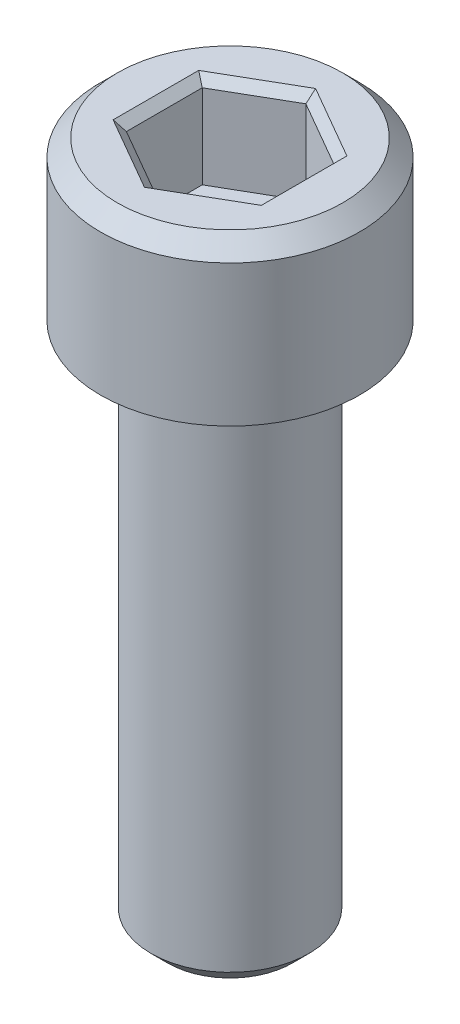
ISO-10303-21;
HEADER;
FILE_DESCRIPTION(('STEP AP214'),'2;1');
FILE_NAME('part.step','',(''),(''),'','','');
FILE_SCHEMA(('AUTOMOTIVE_DESIGN { 1 0 10303 214 1 1 1 1 }'));
ENDSEC;
DATA;
#1=APPLICATION_CONTEXT('core data for automotive mechanical design processes');
#2=APPLICATION_PROTOCOL_DEFINITION('international standard','automotive_design',2000,#1);
#3=PRODUCT_CONTEXT('',#1,'mechanical');
#4=PRODUCT('Part','Part','',(#3));
#5=PRODUCT_RELATED_PRODUCT_CATEGORY('part','',(#4));
#6=PRODUCT_DEFINITION_FORMATION('','',#4);
#7=PRODUCT_DEFINITION_CONTEXT('part definition',#1,'design');
#8=PRODUCT_DEFINITION('design','',#6,#7);
#9=PRODUCT_DEFINITION_SHAPE('','',#8);
#10=(LENGTH_UNIT() NAMED_UNIT(*) SI_UNIT(.MILLI.,.METRE.));
#11=(NAMED_UNIT(*) PLANE_ANGLE_UNIT() SI_UNIT($,.RADIAN.));
#12=(NAMED_UNIT(*) SI_UNIT($,.STERADIAN.) SOLID_ANGLE_UNIT());
#13=UNCERTAINTY_MEASURE_WITH_UNIT(LENGTH_MEASURE(1.E-05),#10,'distance_accuracy_value','');
#14=(GEOMETRIC_REPRESENTATION_CONTEXT(3) GLOBAL_UNCERTAINTY_ASSIGNED_CONTEXT((#13)) GLOBAL_UNIT_ASSIGNED_CONTEXT((#10,
#11,#12)) REPRESENTATION_CONTEXT('',''));
#15=CARTESIAN_POINT('',(0.,0.,0.));
#16=DIRECTION('',(0.,0.,1.));
#17=DIRECTION('',(1.,0.,0.));
#18=AXIS2_PLACEMENT_3D('',#15,#16,#17);
#19=CARTESIAN_POINT('',(-3.96874999999999,-2.79399999999996,0.));
#20=DIRECTION('',(0.,-1.,0.));
#21=DIRECTION('',(0.,0.,-1.));
#22=AXIS2_PLACEMENT_3D('',#19,#20,#21);
#23=PLANE('',#22);
#24=DIRECTION('',(-0.866025403784439,0.,0.5));
#25=VECTOR('',#24,1.);
#26=CARTESIAN_POINT('',(1.98437500000001,-2.79399999999996,1.14567944042317));
#27=LINE('',#26,#25);
#28=CARTESIAN_POINT('',(1.98437500000001,-2.79399999999996,1.14567944042317));
#29=VERTEX_POINT('',#28);
#30=CARTESIAN_POINT('',(0.,-2.79399999999996,2.29135888084634));
#31=VERTEX_POINT('',#30);
#32=EDGE_CURVE('E86',#29,#31,#27,.T.);
#33=ORIENTED_EDGE('',*,*,#32,.F.);
#34=DIRECTION('',(0.,0.,1.));
#35=VECTOR('',#34,1.);
#36=CARTESIAN_POINT('',(1.98437500000001,-2.79399999999996,-1.14567944042316));
#37=LINE('',#36,#35);
#38=CARTESIAN_POINT('',(1.98437500000001,-2.79399999999996,-1.14567944042316));
#39=VERTEX_POINT('',#38);
#40=EDGE_CURVE('E91',#39,#29,#37,.T.);
#41=ORIENTED_EDGE('',*,*,#40,.F.);
#42=DIRECTION('',(0.866025403784439,0.,0.5));
#43=VECTOR('',#42,1.);
#44=CARTESIAN_POINT('',(0.,-2.79399999999996,-2.29135888084632));
#45=LINE('',#44,#43);
#46=CARTESIAN_POINT('',(0.,-2.79399999999996,-2.29135888084632));
#47=VERTEX_POINT('',#46);
#48=EDGE_CURVE('E172',#47,#39,#45,.T.);
#49=ORIENTED_EDGE('',*,*,#48,.F.);
#50=DIRECTION('',(0.866025403784438,0.,-0.500000000000001));
#51=VECTOR('',#50,1.);
#52=CARTESIAN_POINT('',(-1.984375,-2.79399999999996,-1.14567944042316));
#53=LINE('',#52,#51);
#54=CARTESIAN_POINT('',(-1.984375,-2.79399999999996,-1.14567944042316));
#55=VERTEX_POINT('',#54);
#56=EDGE_CURVE('E178',#55,#47,#53,.T.);
#57=ORIENTED_EDGE('',*,*,#56,.F.);
#58=DIRECTION('',(0.,0.,-1.));
#59=VECTOR('',#58,1.);
#60=CARTESIAN_POINT('',(-1.984375,-2.79399999999996,1.14567944042317));
#61=LINE('',#60,#59);
#62=CARTESIAN_POINT('',(-1.984375,-2.79399999999996,1.14567944042317));
#63=VERTEX_POINT('',#62);
#64=EDGE_CURVE('E183',#63,#55,#61,.T.);
#65=ORIENTED_EDGE('',*,*,#64,.F.);
#66=DIRECTION('',(-0.866025403784438,0.,-0.5));
#67=VECTOR('',#66,1.);
#68=CARTESIAN_POINT('',(0.,-2.79399999999996,2.29135888084634));
#69=LINE('',#68,#67);
#70=EDGE_CURVE('E102',#31,#63,#69,.T.);
#71=ORIENTED_EDGE('',*,*,#70,.F.);
#72=EDGE_LOOP('',(#33,#41,#49,#57,#65,#71));
#73=FACE_BOUND('',#72,.T.);
#74=ADVANCED_FACE('F17',(#73),#23,.F.);
#75=CARTESIAN_POINT('',(1.98437500000001,-2.79399999999996,-1.14567944042316));
#76=DIRECTION('',(-1.,0.,0.));
#77=DIRECTION('',(0.,0.,1.));
#78=AXIS2_PLACEMENT_3D('',#75,#76,#77);
#79=PLANE('',#78);
#80=DIRECTION('',(0.,1.,0.));
#81=VECTOR('',#80,1.);
#82=CARTESIAN_POINT('',(1.98437500000001,-2.79399999999996,-1.14567944042315));
#83=LINE('',#82,#81);
#84=CARTESIAN_POINT('',(1.98437500000001,-0.25399999999998,-1.14567944042316));
#85=VERTEX_POINT('',#84);
#86=EDGE_CURVE('E96',#39,#85,#83,.T.);
#87=ORIENTED_EDGE('',*,*,#86,.F.);
#88=ORIENTED_EDGE('',*,*,#40,.T.);
#89=DIRECTION('',(0.,1.,0.));
#90=VECTOR('',#89,1.);
#91=CARTESIAN_POINT('',(1.98437500000001,-2.79399999999996,1.14567944042317));
#92=LINE('',#91,#90);
#93=CARTESIAN_POINT('',(1.98437500000001,-0.253999999999979,1.14567944042318));
#94=VERTEX_POINT('',#93);
#95=EDGE_CURVE('E93',#94,#29,#92,.F.);
#96=ORIENTED_EDGE('',*,*,#95,.F.);
#97=DIRECTION('',(0.,0.,1.));
#98=VECTOR('',#97,1.);
#99=CARTESIAN_POINT('',(1.98437500000002,-0.253999999999987,0.));
#100=LINE('',#99,#98);
#101=EDGE_CURVE('E170',#94,#85,#100,.F.);
#102=ORIENTED_EDGE('',*,*,#101,.T.);
#103=EDGE_LOOP('',(#87,#88,#96,#102));
#104=FACE_BOUND('',#103,.T.);
#105=ADVANCED_FACE('F92',(#104),#79,.T.);
#106=CARTESIAN_POINT('',(1.98437500000001,-2.79399999999996,1.14567944042317));
#107=DIRECTION('',(-0.5,0.,-0.866025403784439));
#108=DIRECTION('',(-0.866025403784439,0.,0.5));
#109=AXIS2_PLACEMENT_3D('',#106,#107,#108);
#110=PLANE('',#109);
#111=ORIENTED_EDGE('',*,*,#95,.T.);
#112=ORIENTED_EDGE('',*,*,#32,.T.);
#113=DIRECTION('',(0.,1.,0.));
#114=VECTOR('',#113,1.);
#115=CARTESIAN_POINT('',(0.,-2.79399999999996,2.29135888084634));
#116=LINE('',#115,#114);
#117=CARTESIAN_POINT('',(0.,-0.253999999999979,2.29135888084634));
#118=VERTEX_POINT('',#117);
#119=EDGE_CURVE('E104',#118,#31,#116,.F.);
#120=ORIENTED_EDGE('',*,*,#119,.F.);
#121=DIRECTION('',(0.866025403784439,0.,-0.5));
#122=VECTOR('',#121,1.);
#123=CARTESIAN_POINT('',(0.,-0.253999999999987,2.29135888084635));
#124=LINE('',#123,#122);
#125=EDGE_CURVE('E108',#118,#94,#124,.T.);
#126=ORIENTED_EDGE('',*,*,#125,.T.);
#127=EDGE_LOOP('',(#111,#112,#120,#126));
#128=FACE_BOUND('',#127,.T.);
#129=ADVANCED_FACE('F106',(#128),#110,.T.);
#130=CARTESIAN_POINT('',(0.,-2.79399999999996,2.29135888084634));
#131=DIRECTION('',(0.5,0.,-0.866025403784438));
#132=DIRECTION('',(-0.866025403784438,0.,-0.5));
#133=AXIS2_PLACEMENT_3D('',#130,#131,#132);
#134=PLANE('',#133);
#135=ORIENTED_EDGE('',*,*,#119,.T.);
#136=ORIENTED_EDGE('',*,*,#70,.T.);
#137=DIRECTION('',(0.,1.,0.));
#138=VECTOR('',#137,1.);
#139=CARTESIAN_POINT('',(-1.984375,-2.79399999999996,1.14567944042317));
#140=LINE('',#139,#138);
#141=CARTESIAN_POINT('',(-1.984375,-0.253999999999979,1.14567944042317));
#142=VERTEX_POINT('',#141);
#143=EDGE_CURVE('E185',#142,#63,#140,.F.);
#144=ORIENTED_EDGE('',*,*,#143,.F.);
#145=DIRECTION('',(0.866025403784438,0.,0.5));
#146=VECTOR('',#145,1.);
#147=CARTESIAN_POINT('',(-1.984375,-0.253999999999986,1.14567944042318));
#148=LINE('',#147,#146);
#149=EDGE_CURVE('E164',#142,#118,#148,.T.);
#150=ORIENTED_EDGE('',*,*,#149,.T.);
#151=EDGE_LOOP('',(#135,#136,#144,#150));
#152=FACE_BOUND('',#151,.T.);
#153=ADVANCED_FACE('F189',(#152),#134,.T.);
#154=CARTESIAN_POINT('',(-1.984375,-2.79399999999996,1.14567944042317));
#155=DIRECTION('',(1.,0.,0.));
#156=DIRECTION('',(0.,0.,-1.));
#157=AXIS2_PLACEMENT_3D('',#154,#155,#156);
#158=PLANE('',#157);
#159=ORIENTED_EDGE('',*,*,#143,.T.);
#160=ORIENTED_EDGE('',*,*,#64,.T.);
#161=DIRECTION('',(0.,1.,0.));
#162=VECTOR('',#161,1.);
#163=CARTESIAN_POINT('',(-1.984375,-2.79399999999996,-1.14567944042316));
#164=LINE('',#163,#162);
#165=CARTESIAN_POINT('',(-1.984375,-0.253999999999979,-1.14567944042316));
#166=VERTEX_POINT('',#165);
#167=EDGE_CURVE('E180',#166,#55,#164,.F.);
#168=ORIENTED_EDGE('',*,*,#167,.F.);
#169=DIRECTION('',(0.,0.,1.));
#170=VECTOR('',#169,1.);
#171=CARTESIAN_POINT('',(-1.98437500000001,-0.253999999999987,0.));
#172=LINE('',#171,#170);
#173=EDGE_CURVE('E159',#166,#142,#172,.T.);
#174=ORIENTED_EDGE('',*,*,#173,.T.);
#175=EDGE_LOOP('',(#159,#160,#168,#174));
#176=FACE_BOUND('',#175,.T.);
#177=ADVANCED_FACE('F219',(#176),#158,.T.);
#178=CARTESIAN_POINT('',(-1.984375,-2.79399999999996,-1.14567944042316));
#179=DIRECTION('',(0.500000000000001,0.,0.866025403784438));
#180=DIRECTION('',(0.866025403784438,0.,-0.500000000000001));
#181=AXIS2_PLACEMENT_3D('',#178,#179,#180);
#182=PLANE('',#181);
#183=ORIENTED_EDGE('',*,*,#167,.T.);
#184=ORIENTED_EDGE('',*,*,#56,.T.);
#185=DIRECTION('',(0.,1.,0.));
#186=VECTOR('',#185,1.);
#187=CARTESIAN_POINT('',(0.,-2.79399999999996,-2.29135888084632));
#188=LINE('',#187,#186);
#189=CARTESIAN_POINT('',(0.,-0.253999999999979,-2.29135888084633));
#190=VERTEX_POINT('',#189);
#191=EDGE_CURVE('E174',#190,#47,#188,.F.);
#192=ORIENTED_EDGE('',*,*,#191,.F.);
#193=DIRECTION('',(-0.866025403784439,0.,0.499999999999999));
#194=VECTOR('',#193,1.);
#195=CARTESIAN_POINT('',(0.,-0.25399999999999,-2.29135888084633));
#196=LINE('',#195,#194);
#197=EDGE_CURVE('E154',#190,#166,#196,.T.);
#198=ORIENTED_EDGE('',*,*,#197,.T.);
#199=EDGE_LOOP('',(#183,#184,#192,#198));
#200=FACE_BOUND('',#199,.T.);
#201=ADVANCED_FACE('F215',(#200),#182,.T.);
#202=CARTESIAN_POINT('',(0.,-2.79399999999996,-2.29135888084632));
#203=DIRECTION('',(-0.5,0.,0.866025403784439));
#204=DIRECTION('',(0.866025403784439,0.,0.5));
#205=AXIS2_PLACEMENT_3D('',#202,#203,#204);
#206=PLANE('',#205);
#207=ORIENTED_EDGE('',*,*,#191,.T.);
#208=ORIENTED_EDGE('',*,*,#48,.T.);
#209=ORIENTED_EDGE('',*,*,#86,.T.);
#210=DIRECTION('',(-0.866025403784439,0.,-0.499999999999999));
#211=VECTOR('',#210,1.);
#212=CARTESIAN_POINT('',(1.98437500000001,-0.253999999999985,-1.14567944042317));
#213=LINE('',#212,#211);
#214=EDGE_CURVE('E146',#85,#190,#213,.T.);
#215=ORIENTED_EDGE('',*,*,#214,.T.);
#216=EDGE_LOOP('',(#207,#208,#209,#215));
#217=FACE_BOUND('',#216,.T.);
#218=ADVANCED_FACE('F210',(#217),#206,.T.);
#219=CARTESIAN_POINT('',(2.23837500000001,0.,0.));
#220=DIRECTION('',(0.707106781186548,-0.707106781186548,0.));
#221=DIRECTION('',(0.707106781186548,0.707106781186548,0.));
#222=AXIS2_PLACEMENT_3D('',#219,#220,#221);
#223=PLANE('',#222);
#224=ORIENTED_EDGE('',*,*,#101,.F.);
#225=DIRECTION('',(0.654653670707993,0.654653670707971,0.377964473009212));
#226=VECTOR('',#225,1.);
#227=CARTESIAN_POINT('',(1.98437500000002,-0.253999999999987,1.14567944042318));
#228=LINE('',#227,#226);
#229=CARTESIAN_POINT('',(2.23837500000001,0.,1.29232640879733));
#230=VERTEX_POINT('',#229);
#231=EDGE_CURVE('E167',#94,#230,#228,.T.);
#232=ORIENTED_EDGE('',*,*,#231,.T.);
#233=DIRECTION('',(0.,0.,1.));
#234=VECTOR('',#233,1.);
#235=CARTESIAN_POINT('',(2.23837500000001,0.,0.));
#236=LINE('',#235,#234);
#237=CARTESIAN_POINT('',(2.23837500000001,0.,-1.29232640879732));
#238=VERTEX_POINT('',#237);
#239=EDGE_CURVE('E142',#238,#230,#236,.T.);
#240=ORIENTED_EDGE('',*,*,#239,.F.);
#241=DIRECTION('',(-0.654653670707993,-0.65465367070797,0.377964473009211));
#242=VECTOR('',#241,1.);
#243=CARTESIAN_POINT('',(2.23837500000001,0.,-1.29232640879732));
#244=LINE('',#243,#242);
#245=EDGE_CURVE('E149',#238,#85,#244,.T.);
#246=ORIENTED_EDGE('',*,*,#245,.T.);
#247=EDGE_LOOP('',(#224,#232,#240,#246));
#248=FACE_BOUND('',#247,.T.);
#249=ADVANCED_FACE('F205',(#248),#223,.F.);
#250=CARTESIAN_POINT('',(1.11918750000001,0.,1.938489613196));
#251=DIRECTION('',(0.353553390593273,-0.707106781186548,0.612372435695794));
#252=DIRECTION('',(0.,-0.654653670707977,-0.755928946018455));
#253=AXIS2_PLACEMENT_3D('',#250,#251,#252);
#254=PLANE('',#253);
#255=ORIENTED_EDGE('',*,*,#125,.F.);
#256=DIRECTION('',(0.,-0.654653670707977,-0.755928946018455));
#257=VECTOR('',#256,1.);
#258=CARTESIAN_POINT('',(0.,-0.319767857142858,2.21541670079542));
#259=LINE('',#258,#257);
#260=CARTESIAN_POINT('',(0.,0.,2.58465281759466));
#261=VERTEX_POINT('',#260);
#262=EDGE_CURVE('E162',#118,#261,#259,.F.);
#263=ORIENTED_EDGE('',*,*,#262,.T.);
#264=DIRECTION('',(-0.866025403784438,0.,0.500000000000001));
#265=VECTOR('',#264,1.);
#266=CARTESIAN_POINT('',(2.23837500000001,0.,1.29232640879733));
#267=LINE('',#266,#265);
#268=EDGE_CURVE('E139',#230,#261,#267,.T.);
#269=ORIENTED_EDGE('',*,*,#268,.F.);
#270=ORIENTED_EDGE('',*,*,#231,.F.);
#271=EDGE_LOOP('',(#255,#263,#269,#270));
#272=FACE_BOUND('',#271,.T.);
#273=ADVANCED_FACE('F196',(#272),#254,.F.);
#274=CARTESIAN_POINT('',(-1.1191875,0.,1.938489613196));
#275=DIRECTION('',(-0.353553390593274,-0.707106781186548,0.612372435695794));
#276=DIRECTION('',(0.,-0.654653670707977,-0.755928946018455));
#277=AXIS2_PLACEMENT_3D('',#274,#275,#276);
#278=PLANE('',#277);
#279=DIRECTION('',(-0.866025403784438,0.,-0.500000000000001));
#280=VECTOR('',#279,1.);
#281=CARTESIAN_POINT('',(0.,0.,2.58465281759467));
#282=LINE('',#281,#280);
#283=CARTESIAN_POINT('',(-2.23837499999999,0.,1.29232640879733));
#284=VERTEX_POINT('',#283);
#285=EDGE_CURVE('E136',#261,#284,#282,.T.);
#286=ORIENTED_EDGE('',*,*,#285,.F.);
#287=ORIENTED_EDGE('',*,*,#262,.F.);
#288=ORIENTED_EDGE('',*,*,#149,.F.);
#289=DIRECTION('',(-0.654653670707976,0.654653670707976,0.377964473009231));
#290=VECTOR('',#289,1.);
#291=CARTESIAN_POINT('',(-1.98437500000001,-0.253999999999987,1.14567944042317));
#292=LINE('',#291,#290);
#293=EDGE_CURVE('E157',#142,#284,#292,.T.);
#294=ORIENTED_EDGE('',*,*,#293,.T.);
#295=EDGE_LOOP('',(#286,#287,#288,#294));
#296=FACE_BOUND('',#295,.T.);
#297=ADVANCED_FACE('F199',(#296),#278,.F.);
#298=CARTESIAN_POINT('',(-2.23837499999999,0.,0.));
#299=DIRECTION('',(-0.707106781186548,-0.707106781186548,0.));
#300=DIRECTION('',(0.707106781186548,-0.707106781186548,0.));
#301=AXIS2_PLACEMENT_3D('',#298,#299,#300);
#302=PLANE('',#301);
#303=DIRECTION('',(0.,0.,1.));
#304=VECTOR('',#303,1.);
#305=CARTESIAN_POINT('',(-2.23837499999999,0.,0.));
#306=LINE('',#305,#304);
#307=CARTESIAN_POINT('',(-2.23837499999999,0.,-1.29232640879732));
#308=VERTEX_POINT('',#307);
#309=EDGE_CURVE('E133',#284,#308,#306,.F.);
#310=ORIENTED_EDGE('',*,*,#309,.F.);
#311=ORIENTED_EDGE('',*,*,#293,.F.);
#312=ORIENTED_EDGE('',*,*,#173,.F.);
#313=DIRECTION('',(-0.654653670707992,0.654653670707971,-0.377964473009212));
#314=VECTOR('',#313,1.);
#315=CARTESIAN_POINT('',(-1.984375,-0.253999999999987,-1.14567944042317));
#316=LINE('',#315,#314);
#317=EDGE_CURVE('E152',#166,#308,#316,.T.);
#318=ORIENTED_EDGE('',*,*,#317,.T.);
#319=EDGE_LOOP('',(#310,#311,#312,#318));
#320=FACE_BOUND('',#319,.T.);
#321=ADVANCED_FACE('F217',(#320),#302,.F.);
#322=CARTESIAN_POINT('',(-1.11918749999999,0.,-1.93848961319599));
#323=DIRECTION('',(-0.353553390593274,-0.707106781186548,-0.612372435695794));
#324=DIRECTION('',(0.,0.654653670707977,-0.755928946018455));
#325=AXIS2_PLACEMENT_3D('',#322,#323,#324);
#326=PLANE('',#325);
#327=ORIENTED_EDGE('',*,*,#197,.F.);
#328=DIRECTION('',(0.,0.654653670707977,-0.755928946018455));
#329=VECTOR('',#328,1.);
#330=CARTESIAN_POINT('',(0.,-0.319767857142854,-2.21541670079541));
#331=LINE('',#330,#329);
#332=CARTESIAN_POINT('',(0.,0.,-2.58465281759465));
#333=VERTEX_POINT('',#332);
#334=EDGE_CURVE('E35',#190,#333,#331,.T.);
#335=ORIENTED_EDGE('',*,*,#334,.T.);
#336=DIRECTION('',(0.866025403784438,0.,-0.500000000000001));
#337=VECTOR('',#336,1.);
#338=CARTESIAN_POINT('',(-2.23837499999999,0.,-1.29232640879732));
#339=LINE('',#338,#337);
#340=EDGE_CURVE('E130',#308,#333,#339,.T.);
#341=ORIENTED_EDGE('',*,*,#340,.F.);
#342=ORIENTED_EDGE('',*,*,#317,.F.);
#343=EDGE_LOOP('',(#327,#335,#341,#342));
#344=FACE_BOUND('',#343,.T.);
#345=ADVANCED_FACE('F212',(#344),#326,.F.);
#346=CARTESIAN_POINT('',(1.1191875,0.,-1.93848961319599));
#347=DIRECTION('',(0.353553390593274,-0.707106781186548,-0.612372435695794));
#348=DIRECTION('',(0.,0.654653670707977,-0.755928946018455));
#349=AXIS2_PLACEMENT_3D('',#346,#347,#348);
#350=PLANE('',#349);
#351=ORIENTED_EDGE('',*,*,#214,.F.);
#352=ORIENTED_EDGE('',*,*,#245,.F.);
#353=DIRECTION('',(0.866025403784438,0.,0.500000000000001));
#354=VECTOR('',#353,1.);
#355=CARTESIAN_POINT('',(0.,0.,-2.58465281759465));
#356=LINE('',#355,#354);
#357=EDGE_CURVE('E125',#333,#238,#356,.T.);
#358=ORIENTED_EDGE('',*,*,#357,.F.);
#359=ORIENTED_EDGE('',*,*,#334,.F.);
#360=EDGE_LOOP('',(#351,#352,#358,#359));
#361=FACE_BOUND('',#360,.T.);
#362=ADVANCED_FACE('F208',(#361),#350,.F.);
#363=CARTESIAN_POINT('',(0.,0.,0.));
#364=DIRECTION('',(0.,1.,0.));
#365=DIRECTION('',(0.,0.,1.));
#366=AXIS2_PLACEMENT_3D('',#363,#364,#365);
#367=PLANE('',#366);
#368=CARTESIAN_POINT('',(0.,-5.6843418860808E-11,0.));
#369=DIRECTION('',(0.,-1.,0.));
#370=DIRECTION('',(0.,0.,-1.));
#371=AXIS2_PLACEMENT_3D('',#368,#369,#370);
#372=CIRCLE('',#371,3.40360000001283);
#373=CARTESIAN_POINT('',(0.,-5.6843418860808E-11,-3.40360000001283));
#374=VERTEX_POINT('',#373);
#375=EDGE_CURVE('E20',#374,#374,#372,.T.);
#376=ORIENTED_EDGE('',*,*,#375,.F.);
#377=EDGE_LOOP('',(#376));
#378=FACE_BOUND('',#377,.T.);
#379=ORIENTED_EDGE('',*,*,#340,.T.);
#380=ORIENTED_EDGE('',*,*,#357,.T.);
#381=ORIENTED_EDGE('',*,*,#239,.T.);
#382=ORIENTED_EDGE('',*,*,#268,.T.);
#383=ORIENTED_EDGE('',*,*,#285,.T.);
#384=ORIENTED_EDGE('',*,*,#309,.T.);
#385=EDGE_LOOP('',(#379,#380,#381,#382,#383,#384));
#386=FACE_BOUND('',#385,.T.);
#387=ADVANCED_FACE('F202',(#378,#386),#367,.T.);
#388=CARTESIAN_POINT('',(0.,-0.507999999911135,0.));
#389=DIRECTION('',(0.,-1.,0.));
#390=DIRECTION('',(0.,0.,-1.));
#391=AXIS2_PLACEMENT_3D('',#388,#389,#390);
#392=CONICAL_SURFACE('',#391,3.91159999986712,0.785398163397448);
#393=CARTESIAN_POINT('',(0.,-0.507999999999953,0.));
#394=DIRECTION('',(0.,1.,0.));
#395=DIRECTION('',(0.,0.,1.));
#396=AXIS2_PLACEMENT_3D('',#393,#394,#395);
#397=CIRCLE('',#396,3.9116);
#398=CARTESIAN_POINT('',(0.,-0.507999999999953,3.9116));
#399=VERTEX_POINT('',#398);
#400=EDGE_CURVE('E117',#399,#399,#397,.F.);
#401=ORIENTED_EDGE('',*,*,#400,.F.);
#402=EDGE_LOOP('',(#401));
#403=FACE_BOUND('',#402,.T.);
#404=ORIENTED_EDGE('',*,*,#375,.T.);
#405=EDGE_LOOP('',(#404));
#406=FACE_BOUND('',#405,.T.);
#407=ADVANCED_FACE('F252',(#403,#406),#392,.T.);
#408=CARTESIAN_POINT('',(0.,-20.6502,0.));
#409=DIRECTION('',(0.,1.,0.));
#410=DIRECTION('',(0.,0.,1.));
#411=AXIS2_PLACEMENT_3D('',#408,#409,#410);
#412=PLANE('',#411);
#413=CARTESIAN_POINT('',(0.,-20.6502000000341,0.));
#414=DIRECTION('',(0.,1.,0.));
#415=DIRECTION('',(0.,0.,1.));
#416=AXIS2_PLACEMENT_3D('',#413,#414,#415);
#417=CIRCLE('',#416,1.87959999993836);
#418=CARTESIAN_POINT('',(0.,-20.6502000000341,1.87959999993836));
#419=VERTEX_POINT('',#418);
#420=EDGE_CURVE('E115',#419,#419,#417,.T.);
#421=ORIENTED_EDGE('',*,*,#420,.F.);
#422=EDGE_LOOP('',(#421));
#423=FACE_BOUND('',#422,.T.);
#424=ADVANCED_FACE('F249',(#423),#412,.F.);
#425=CARTESIAN_POINT('',(0.,-4.77520000000009,0.));
#426=DIRECTION('',(0.,1.,0.));
#427=DIRECTION('',(0.,0.,1.));
#428=AXIS2_PLACEMENT_3D('',#425,#426,#427);
#429=CYLINDRICAL_SURFACE('',#428,3.9116);
#430=ORIENTED_EDGE('',*,*,#400,.T.);
#431=EDGE_LOOP('',(#430));
#432=FACE_BOUND('',#431,.T.);
#433=CARTESIAN_POINT('',(0.,-4.77520000000009,0.));
#434=DIRECTION('',(0.,1.,0.));
#435=DIRECTION('',(0.,0.,1.));
#436=AXIS2_PLACEMENT_3D('',#433,#434,#435);
#437=CIRCLE('',#436,3.9116);
#438=CARTESIAN_POINT('',(0.,-4.77520000000009,3.9116));
#439=VERTEX_POINT('',#438);
#440=EDGE_CURVE('E113',#439,#439,#437,.T.);
#441=ORIENTED_EDGE('',*,*,#440,.T.);
#442=EDGE_LOOP('',(#441));
#443=FACE_BOUND('',#442,.T.);
#444=ADVANCED_FACE('F245',(#432,#443),#429,.T.);
#445=CARTESIAN_POINT('',(0.,-20.1421999998956,0.));
#446=DIRECTION('',(0.,1.,0.));
#447=DIRECTION('',(0.,0.,1.));
#448=AXIS2_PLACEMENT_3D('',#445,#446,#447);
#449=CONICAL_SURFACE('',#448,2.38760000007687,0.785398163397448);
#450=CARTESIAN_POINT('',(0.,-20.1422,0.));
#451=DIRECTION('',(0.,1.,0.));
#452=DIRECTION('',(0.,0.,1.));
#453=AXIS2_PLACEMENT_3D('',#450,#451,#452);
#454=CIRCLE('',#453,2.3876);
#455=CARTESIAN_POINT('',(0.,-20.1422,2.3876));
#456=VERTEX_POINT('',#455);
#457=EDGE_CURVE('E26',#456,#456,#454,.T.);
#458=ORIENTED_EDGE('',*,*,#457,.F.);
#459=EDGE_LOOP('',(#458));
#460=FACE_BOUND('',#459,.T.);
#461=ORIENTED_EDGE('',*,*,#420,.T.);
#462=EDGE_LOOP('',(#461));
#463=FACE_BOUND('',#462,.T.);
#464=ADVANCED_FACE('F238',(#460,#463),#449,.T.);
#465=CARTESIAN_POINT('',(0.,-4.77520000000009,0.));
#466=DIRECTION('',(0.,1.,0.));
#467=DIRECTION('',(0.,0.,1.));
#468=AXIS2_PLACEMENT_3D('',#465,#466,#467);
#469=PLANE('',#468);
#470=ORIENTED_EDGE('',*,*,#440,.F.);
#471=EDGE_LOOP('',(#470));
#472=FACE_BOUND('',#471,.T.);
#473=CARTESIAN_POINT('',(0.,-4.77520000000009,0.));
#474=DIRECTION('',(0.,1.,0.));
#475=DIRECTION('',(0.,0.,1.));
#476=AXIS2_PLACEMENT_3D('',#473,#474,#475);
#477=CIRCLE('',#476,2.3876);
#478=CARTESIAN_POINT('',(0.,-4.77520000000009,2.3876));
#479=VERTEX_POINT('',#478);
#480=EDGE_CURVE('E11',#479,#479,#477,.F.);
#481=ORIENTED_EDGE('',*,*,#480,.F.);
#482=EDGE_LOOP('',(#481));
#483=FACE_BOUND('',#482,.T.);
#484=ADVANCED_FACE('F232',(#472,#483),#469,.F.);
#485=CARTESIAN_POINT('',(0.,-20.6502,0.));
#486=DIRECTION('',(0.,1.,0.));
#487=DIRECTION('',(0.,0.,1.));
#488=AXIS2_PLACEMENT_3D('',#485,#486,#487);
#489=CYLINDRICAL_SURFACE('',#488,2.3876);
#490=ORIENTED_EDGE('',*,*,#480,.T.);
#491=EDGE_LOOP('',(#490));
#492=FACE_BOUND('',#491,.T.);
#493=ORIENTED_EDGE('',*,*,#457,.T.);
#494=EDGE_LOOP('',(#493));
#495=FACE_BOUND('',#494,.T.);
#496=ADVANCED_FACE('F230',(#492,#495),#489,.T.);
#497=CLOSED_SHELL('',(#74,#105,#129,#153,#177,#201,#218,#249,#273,#297,#321,#345,#362,#387,#407,
#424,#444,#464,#484,#496));
#498=MANIFOLD_SOLID_BREP('B1',#497);
#499=ADVANCED_BREP_SHAPE_REPRESENTATION('',(#18,#498),#14);
#500=SHAPE_DEFINITION_REPRESENTATION(#9,#499);
ENDSEC;
END-ISO-10303-21;
